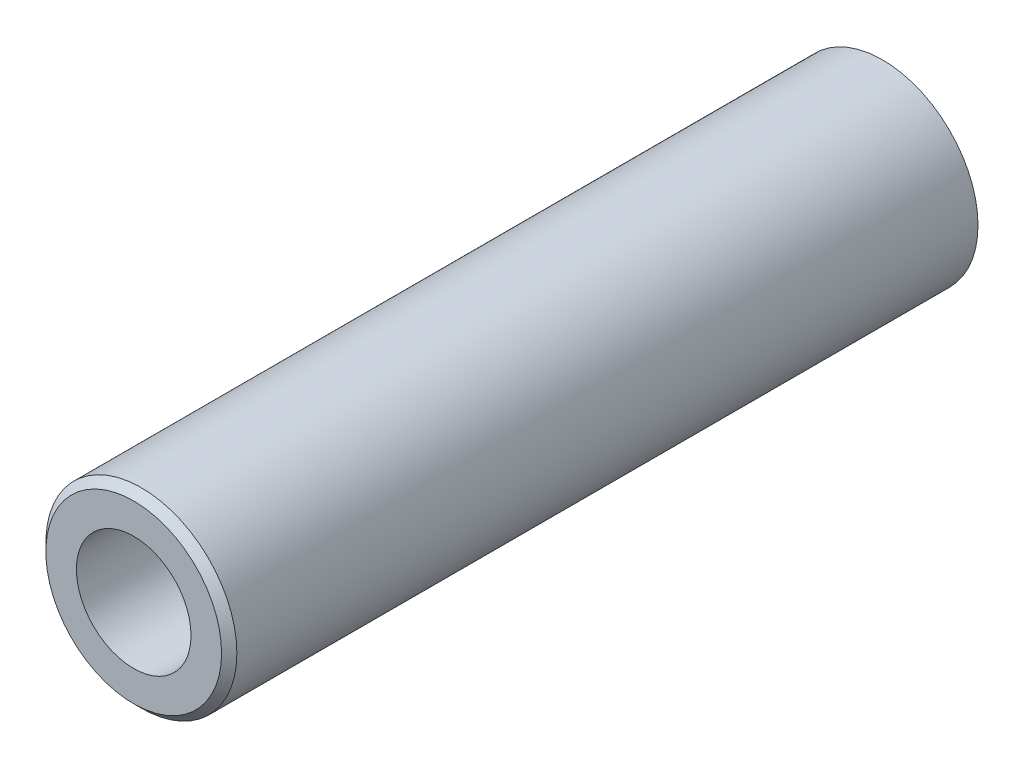
ISO-10303-21;
HEADER;
FILE_DESCRIPTION(('STEP AP214'),'2;1');
FILE_NAME('part.step','',(''),(''),'','','');
FILE_SCHEMA(('AUTOMOTIVE_DESIGN { 1 0 10303 214 1 1 1 1 }'));
ENDSEC;
DATA;
#1=APPLICATION_CONTEXT('core data for automotive mechanical design processes');
#2=APPLICATION_PROTOCOL_DEFINITION('international standard','automotive_design',2000,#1);
#3=PRODUCT_CONTEXT('',#1,'mechanical');
#4=PRODUCT('Part','Part','',(#3));
#5=PRODUCT_RELATED_PRODUCT_CATEGORY('part','',(#4));
#6=PRODUCT_DEFINITION_FORMATION('','',#4);
#7=PRODUCT_DEFINITION_CONTEXT('part definition',#1,'design');
#8=PRODUCT_DEFINITION('design','',#6,#7);
#9=PRODUCT_DEFINITION_SHAPE('','',#8);
#10=(LENGTH_UNIT() NAMED_UNIT(*) SI_UNIT(.MILLI.,.METRE.));
#11=(NAMED_UNIT(*) PLANE_ANGLE_UNIT() SI_UNIT($,.RADIAN.));
#12=(NAMED_UNIT(*) SI_UNIT($,.STERADIAN.) SOLID_ANGLE_UNIT());
#13=UNCERTAINTY_MEASURE_WITH_UNIT(LENGTH_MEASURE(1.E-05),#10,'distance_accuracy_value','');
#14=(GEOMETRIC_REPRESENTATION_CONTEXT(3) GLOBAL_UNCERTAINTY_ASSIGNED_CONTEXT((#13)) GLOBAL_UNIT_ASSIGNED_CONTEXT((#10,
#11,#12)) REPRESENTATION_CONTEXT('',''));
#15=CARTESIAN_POINT('',(0.,0.,0.));
#16=DIRECTION('',(0.,0.,1.));
#17=DIRECTION('',(1.,0.,0.));
#18=AXIS2_PLACEMENT_3D('',#15,#16,#17);
#19=CARTESIAN_POINT('',(0.,0.,24.5));
#20=DIRECTION('',(0.,0.,1.));
#21=DIRECTION('',(1.,0.,0.));
#22=AXIS2_PLACEMENT_3D('',#19,#20,#21);
#23=PLANE('',#22);
#24=CARTESIAN_POINT('',(0.,0.,24.5));
#25=DIRECTION('',(0.,0.,1.));
#26=DIRECTION('',(1.,0.,0.));
#27=AXIS2_PLACEMENT_3D('',#24,#25,#26);
#28=CIRCLE('',#27,5.75);
#29=CARTESIAN_POINT('',(5.75,0.,24.5));
#30=VERTEX_POINT('',#29);
#31=EDGE_CURVE('E54',#30,#30,#28,.T.);
#32=ORIENTED_EDGE('',*,*,#31,.T.);
#33=EDGE_LOOP('',(#32));
#34=FACE_BOUND('',#33,.T.);
#35=CARTESIAN_POINT('',(0.,0.,24.5));
#36=DIRECTION('',(0.,0.,1.));
#37=DIRECTION('',(1.,0.,0.));
#38=AXIS2_PLACEMENT_3D('',#35,#36,#37);
#39=CIRCLE('',#38,3.75);
#40=CARTESIAN_POINT('',(3.75,0.,24.5));
#41=VERTEX_POINT('',#40);
#42=EDGE_CURVE('E64',#41,#41,#39,.T.);
#43=ORIENTED_EDGE('',*,*,#42,.F.);
#44=EDGE_LOOP('',(#43));
#45=FACE_BOUND('',#44,.T.);
#46=ADVANCED_FACE('F45',(#34,#45),#23,.T.);
#47=CARTESIAN_POINT('',(0.,0.,-24.5));
#48=DIRECTION('',(0.,0.,1.));
#49=DIRECTION('',(1.,0.,0.));
#50=AXIS2_PLACEMENT_3D('',#47,#48,#49);
#51=PLANE('',#50);
#52=CARTESIAN_POINT('',(0.,0.,-24.5));
#53=DIRECTION('',(0.,0.,1.));
#54=DIRECTION('',(1.,0.,0.));
#55=AXIS2_PLACEMENT_3D('',#52,#53,#54);
#56=CIRCLE('',#55,6.25);
#57=CARTESIAN_POINT('',(6.25,0.,-24.5));
#58=VERTEX_POINT('',#57);
#59=EDGE_CURVE('E59',#58,#58,#56,.T.);
#60=ORIENTED_EDGE('',*,*,#59,.F.);
#61=EDGE_LOOP('',(#60));
#62=FACE_BOUND('',#61,.T.);
#63=CARTESIAN_POINT('',(0.,0.,-24.5));
#64=DIRECTION('',(0.,0.,1.));
#65=DIRECTION('',(1.,0.,0.));
#66=AXIS2_PLACEMENT_3D('',#63,#64,#65);
#67=CIRCLE('',#66,3.75);
#68=CARTESIAN_POINT('',(3.75,0.,-24.5));
#69=VERTEX_POINT('',#68);
#70=EDGE_CURVE('E67',#69,#69,#67,.T.);
#71=ORIENTED_EDGE('',*,*,#70,.T.);
#72=EDGE_LOOP('',(#71));
#73=FACE_BOUND('',#72,.T.);
#74=ADVANCED_FACE('F79',(#62,#73),#51,.F.);
#75=CARTESIAN_POINT('',(0.,0.,24.5));
#76=DIRECTION('',(0.,0.,-1.));
#77=DIRECTION('',(-1.,0.,0.));
#78=AXIS2_PLACEMENT_3D('',#75,#76,#77);
#79=CYLINDRICAL_SURFACE('',#78,6.25);
#80=CARTESIAN_POINT('',(0.,0.,24.));
#81=DIRECTION('',(0.,0.,1.));
#82=DIRECTION('',(1.,0.,0.));
#83=AXIS2_PLACEMENT_3D('',#80,#81,#82);
#84=CIRCLE('',#83,6.25);
#85=CARTESIAN_POINT('',(6.25,0.,24.));
#86=VERTEX_POINT('',#85);
#87=EDGE_CURVE('E11',#86,#86,#84,.F.);
#88=ORIENTED_EDGE('',*,*,#87,.T.);
#89=EDGE_LOOP('',(#88));
#90=FACE_BOUND('',#89,.T.);
#91=ORIENTED_EDGE('',*,*,#59,.T.);
#92=EDGE_LOOP('',(#91));
#93=FACE_BOUND('',#92,.T.);
#94=ADVANCED_FACE('F84',(#90,#93),#79,.T.);
#95=CARTESIAN_POINT('',(0.,0.,24.5));
#96=DIRECTION('',(0.,0.,-1.));
#97=DIRECTION('',(-1.,0.,0.));
#98=AXIS2_PLACEMENT_3D('',#95,#96,#97);
#99=CYLINDRICAL_SURFACE('',#98,3.75);
#100=ORIENTED_EDGE('',*,*,#42,.T.);
#101=EDGE_LOOP('',(#100));
#102=FACE_BOUND('',#101,.T.);
#103=ORIENTED_EDGE('',*,*,#70,.F.);
#104=EDGE_LOOP('',(#103));
#105=FACE_BOUND('',#104,.T.);
#106=ADVANCED_FACE('F75',(#102,#105),#99,.F.);
#107=CARTESIAN_POINT('',(0.,0.,24.5));
#108=DIRECTION('',(0.,0.,-1.));
#109=DIRECTION('',(-1.,0.,0.));
#110=AXIS2_PLACEMENT_3D('',#107,#108,#109);
#111=CONICAL_SURFACE('',#110,5.75,0.785398163397447);
#112=ORIENTED_EDGE('',*,*,#87,.F.);
#113=EDGE_LOOP('',(#112));
#114=FACE_BOUND('',#113,.T.);
#115=ORIENTED_EDGE('',*,*,#31,.F.);
#116=EDGE_LOOP('',(#115));
#117=FACE_BOUND('',#116,.T.);
#118=ADVANCED_FACE('F48',(#114,#117),#111,.T.);
#119=CLOSED_SHELL('',(#46,#74,#94,#106,#118));
#120=MANIFOLD_SOLID_BREP('B2',#119);
#121=ADVANCED_BREP_SHAPE_REPRESENTATION('',(#18,#120),#14);
#122=SHAPE_DEFINITION_REPRESENTATION(#9,#121);
ENDSEC;
END-ISO-10303-21;
